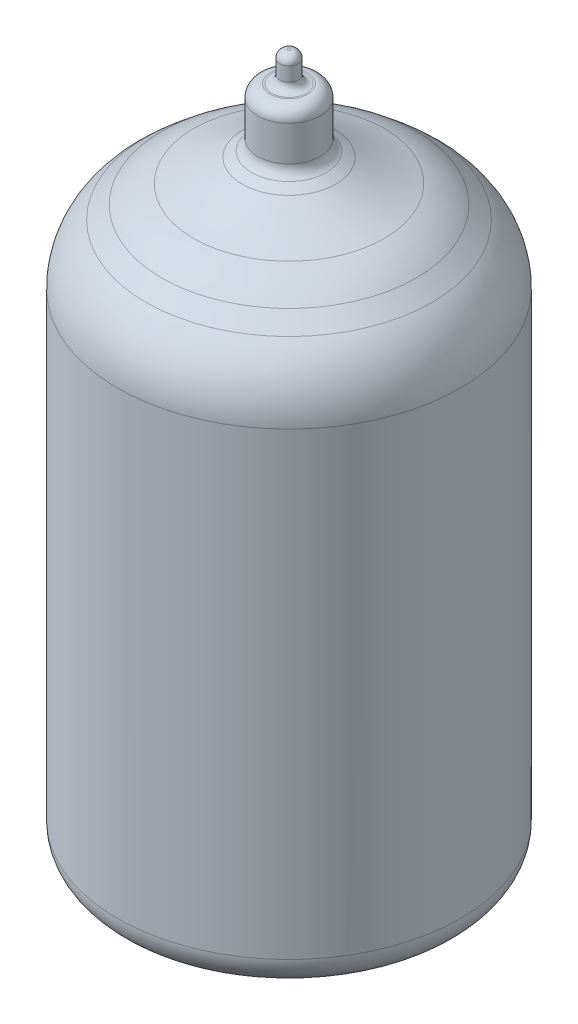
ISO-10303-21;
HEADER;
FILE_DESCRIPTION(('STEP AP214'),'2;1');
FILE_NAME('part.step','',(''),(''),'','','');
FILE_SCHEMA(('AUTOMOTIVE_DESIGN { 1 0 10303 214 1 1 1 1 }'));
ENDSEC;
DATA;
#1=APPLICATION_CONTEXT('core data for automotive mechanical design processes');
#2=APPLICATION_PROTOCOL_DEFINITION('international standard','automotive_design',2000,#1);
#3=PRODUCT_CONTEXT('',#1,'mechanical');
#4=PRODUCT('Part','Part','',(#3));
#5=PRODUCT_RELATED_PRODUCT_CATEGORY('part','',(#4));
#6=PRODUCT_DEFINITION_FORMATION('','',#4);
#7=PRODUCT_DEFINITION_CONTEXT('part definition',#1,'design');
#8=PRODUCT_DEFINITION('design','',#6,#7);
#9=PRODUCT_DEFINITION_SHAPE('','',#8);
#10=(LENGTH_UNIT() NAMED_UNIT(*) SI_UNIT(.MILLI.,.METRE.));
#11=(NAMED_UNIT(*) PLANE_ANGLE_UNIT() SI_UNIT($,.RADIAN.));
#12=(NAMED_UNIT(*) SI_UNIT($,.STERADIAN.) SOLID_ANGLE_UNIT());
#13=UNCERTAINTY_MEASURE_WITH_UNIT(LENGTH_MEASURE(1.E-05),#10,'distance_accuracy_value','');
#14=(GEOMETRIC_REPRESENTATION_CONTEXT(3) GLOBAL_UNCERTAINTY_ASSIGNED_CONTEXT((#13)) GLOBAL_UNIT_ASSIGNED_CONTEXT((#10,
#11,#12)) REPRESENTATION_CONTEXT('',''));
#15=CARTESIAN_POINT('',(0.,0.,0.));
#16=DIRECTION('',(0.,0.,1.));
#17=DIRECTION('',(1.,0.,0.));
#18=AXIS2_PLACEMENT_3D('',#15,#16,#17);
#19=CARTESIAN_POINT('',(0.,35.,0.));
#20=DIRECTION('',(0.,-1.,0.));
#21=DIRECTION('',(0.,0.,-1.));
#22=AXIS2_PLACEMENT_3D('',#19,#20,#21);
#23=CONICAL_SURFACE('',#22,11.0000000000001,0.880869672137726);
#24=CARTESIAN_POINT('',(0.,37.3414230678486,0.));
#25=DIRECTION('',(0.,1.,0.));
#26=DIRECTION('',(0.,0.,1.));
#27=AXIS2_PLACEMENT_3D('',#24,#25,#26);
#28=CIRCLE('',#27,8.16264331971948);
#29=CARTESIAN_POINT('',(0.,37.3414230678486,8.16264331971948));
#30=VERTEX_POINT('',#29);
#31=EDGE_CURVE('E69',#30,#30,#28,.F.);
#32=ORIENTED_EDGE('',*,*,#31,.T.);
#33=EDGE_LOOP('',(#32));
#34=FACE_BOUND('',#33,.T.);
#35=CARTESIAN_POINT('',(0.,36.4999042661148,0.));
#36=DIRECTION('',(0.,1.,0.));
#37=DIRECTION('',(0.,0.,1.));
#38=AXIS2_PLACEMENT_3D('',#35,#36,#37);
#39=CIRCLE('',#38,9.18240306603264);
#40=CARTESIAN_POINT('',(0.,36.4999042661148,9.18240306603264));
#41=VERTEX_POINT('',#40);
#42=EDGE_CURVE('E78',#41,#41,#39,.T.);
#43=ORIENTED_EDGE('',*,*,#42,.T.);
#44=EDGE_LOOP('',(#43));
#45=FACE_BOUND('',#44,.T.);
#46=ADVANCED_FACE('F33',(#34,#45),#23,.T.);
#47=CARTESIAN_POINT('',(0.,57.2928245965313,0.));
#48=DIRECTION('',(0.,1.,0.));
#49=DIRECTION('',(0.,0.,1.));
#50=AXIS2_PLACEMENT_3D('',#47,#48,#49);
#51=DEGENERATE_TOROIDAL_SURFACE('',#50,12.9999999999997,20.,.T.);
#52=CARTESIAN_POINT('',(0.,38.5147131680826,0.));
#53=DIRECTION('',(0.,1.,0.));
#54=DIRECTION('',(0.,0.,1.));
#55=AXIS2_PLACEMENT_3D('',#52,#53,#54);
#56=CIRCLE('',#55,6.11650298316582);
#57=CARTESIAN_POINT('',(0.,38.5147131680826,6.11650298316582));
#58=VERTEX_POINT('',#57);
#59=EDGE_CURVE('E72',#58,#58,#56,.T.);
#60=ORIENTED_EDGE('',*,*,#59,.T.);
#61=EDGE_LOOP('',(#60));
#62=FACE_BOUND('',#61,.T.);
#63=CARTESIAN_POINT('',(0.,39.9723165208424,0.));
#64=DIRECTION('',(0.,1.,0.));
#65=DIRECTION('',(0.,0.,1.));
#66=AXIS2_PLACEMENT_3D('',#63,#64,#65);
#67=CIRCLE('',#66,2.99999999999998);
#68=CARTESIAN_POINT('',(0.,39.9723165208424,2.99999999999998));
#69=VERTEX_POINT('',#68);
#70=EDGE_CURVE('E81',#69,#69,#67,.T.);
#71=ORIENTED_EDGE('',*,*,#70,.F.);
#72=EDGE_LOOP('',(#71));
#73=FACE_BOUND('',#72,.T.);
#74=ADVANCED_FACE('F292',(#62,#73),#51,.F.);
#75=CARTESIAN_POINT('',(0.,41.8106123577551,0.));
#76=DIRECTION('',(0.,1.,0.));
#77=DIRECTION('',(0.,0.,1.));
#78=AXIS2_PLACEMENT_3D('',#75,#76,#77);
#79=CYLINDRICAL_SURFACE('',#78,11.0000000000001);
#80=CARTESIAN_POINT('',(0.,32.6434407663126,0.));
#81=DIRECTION('',(0.,-1.,0.));
#82=DIRECTION('',(0.,0.,-1.));
#83=AXIS2_PLACEMENT_3D('',#80,#81,#82);
#84=CIRCLE('',#83,11.0000000000001);
#85=CARTESIAN_POINT('',(0.,32.6434407663126,-11.0000000000001));
#86=VERTEX_POINT('',#85);
#87=EDGE_CURVE('E75',#86,#86,#84,.T.);
#88=ORIENTED_EDGE('',*,*,#87,.T.);
#89=EDGE_LOOP('',(#88));
#90=FACE_BOUND('',#89,.T.);
#91=CARTESIAN_POINT('',(0.,3.17,0.));
#92=DIRECTION('',(0.,1.,0.));
#93=DIRECTION('',(-1.,0.,0.));
#94=AXIS2_PLACEMENT_3D('',#91,#92,#93);
#95=CIRCLE('',#94,11.0000000000001);
#96=CARTESIAN_POINT('',(-11.0000000000001,3.17,0.));
#97=VERTEX_POINT('',#96);
#98=EDGE_CURVE('E129',#97,#97,#95,.T.);
#99=ORIENTED_EDGE('',*,*,#98,.T.);
#100=EDGE_LOOP('',(#99));
#101=FACE_BOUND('',#100,.T.);
#102=ADVANCED_FACE('F288',(#90,#101),#79,.T.);
#103=CARTESIAN_POINT('',(0.,32.6434407663126,0.));
#104=DIRECTION('',(0.,-1.,0.));
#105=DIRECTION('',(0.,0.,-1.));
#106=AXIS2_PLACEMENT_3D('',#103,#104,#105);
#107=TOROIDAL_SURFACE('',#106,6.00000000000012,5.);
#108=ORIENTED_EDGE('',*,*,#87,.F.);
#109=EDGE_LOOP('',(#108));
#110=FACE_BOUND('',#109,.T.);
#111=ORIENTED_EDGE('',*,*,#42,.F.);
#112=EDGE_LOOP('',(#111));
#113=FACE_BOUND('',#112,.T.);
#114=ADVANCED_FACE('F291',(#110,#113),#107,.T.);
#115=CARTESIAN_POINT('',(0.,31.9423741681255,0.));
#116=DIRECTION('',(0.,-1.,0.));
#117=DIRECTION('',(0.,0.,-1.));
#118=AXIS2_PLACEMENT_3D('',#115,#116,#117);
#119=DEGENERATE_TOROIDAL_SURFACE('',#118,3.70727902727395,7.,.T.);
#120=ORIENTED_EDGE('',*,*,#31,.F.);
#121=EDGE_LOOP('',(#120));
#122=FACE_BOUND('',#121,.T.);
#123=ORIENTED_EDGE('',*,*,#59,.F.);
#124=EDGE_LOOP('',(#123));
#125=FACE_BOUND('',#124,.T.);
#126=ADVANCED_FACE('F35',(#122,#125),#119,.T.);
#127=CARTESIAN_POINT('',(0.,39.9723165208424,0.));
#128=DIRECTION('',(0.,-1.,0.));
#129=DIRECTION('',(0.,0.,-1.));
#130=AXIS2_PLACEMENT_3D('',#127,#128,#129);
#131=CONICAL_SURFACE('',#130,2.99999999999999,1.0471975511966);
#132=CARTESIAN_POINT('',(0.,40.3187266823562,0.));
#133=DIRECTION('',(0.,1.,0.));
#134=DIRECTION('',(0.,0.,1.));
#135=AXIS2_PLACEMENT_3D('',#132,#133,#134);
#136=CIRCLE('',#135,2.4);
#137=CARTESIAN_POINT('',(0.,40.3187266823562,2.4));
#138=VERTEX_POINT('',#137);
#139=EDGE_CURVE('E89',#138,#138,#136,.T.);
#140=ORIENTED_EDGE('',*,*,#139,.F.);
#141=EDGE_LOOP('',(#140));
#142=FACE_BOUND('',#141,.T.);
#143=ORIENTED_EDGE('',*,*,#70,.T.);
#144=EDGE_LOOP('',(#143));
#145=FACE_BOUND('',#144,.T.);
#146=ADVANCED_FACE('F259',(#142,#145),#131,.T.);
#147=CARTESIAN_POINT('',(0.,41.0115470053837,0.));
#148=DIRECTION('',(0.,1.,0.));
#149=DIRECTION('',(0.,0.,1.));
#150=AXIS2_PLACEMENT_3D('',#147,#148,#149);
#151=TOROIDAL_SURFACE('',#150,2.8,0.800000000000001);
#152=CARTESIAN_POINT('',(0.,41.0115470053837,0.));
#153=DIRECTION('',(0.,1.,0.));
#154=DIRECTION('',(0.,0.,1.));
#155=AXIS2_PLACEMENT_3D('',#152,#153,#154);
#156=CIRCLE('',#155,2.);
#157=CARTESIAN_POINT('',(0.,41.0115470053837,2.));
#158=VERTEX_POINT('',#157);
#159=EDGE_CURVE('E102',#158,#158,#156,.T.);
#160=ORIENTED_EDGE('',*,*,#159,.F.);
#161=EDGE_LOOP('',(#160));
#162=FACE_BOUND('',#161,.T.);
#163=ORIENTED_EDGE('',*,*,#139,.T.);
#164=EDGE_LOOP('',(#163));
#165=FACE_BOUND('',#164,.T.);
#166=ADVANCED_FACE('F255',(#162,#165),#151,.F.);
#167=CARTESIAN_POINT('',(0.,46.2723165208424,0.));
#168=DIRECTION('',(0.,1.,0.));
#169=DIRECTION('',(0.,0.,1.));
#170=AXIS2_PLACEMENT_3D('',#167,#168,#169);
#171=CYLINDRICAL_SURFACE('',#170,2.);
#172=CARTESIAN_POINT('',(0.,43.2723165208424,0.));
#173=DIRECTION('',(0.,1.,0.));
#174=DIRECTION('',(0.,0.,1.));
#175=AXIS2_PLACEMENT_3D('',#172,#173,#174);
#176=CIRCLE('',#175,2.);
#177=CARTESIAN_POINT('',(0.,43.2723165208424,2.));
#178=VERTEX_POINT('',#177);
#179=EDGE_CURVE('E105',#178,#178,#176,.T.);
#180=ORIENTED_EDGE('',*,*,#179,.F.);
#181=EDGE_LOOP('',(#180));
#182=FACE_BOUND('',#181,.T.);
#183=ORIENTED_EDGE('',*,*,#159,.T.);
#184=EDGE_LOOP('',(#183));
#185=FACE_BOUND('',#184,.T.);
#186=ADVANCED_FACE('F251',(#182,#185),#171,.T.);
#187=CARTESIAN_POINT('',(0.,43.2723165208424,0.));
#188=DIRECTION('',(0.,1.,0.));
#189=DIRECTION('',(0.,0.,1.));
#190=AXIS2_PLACEMENT_3D('',#187,#188,#189);
#191=TOROIDAL_SURFACE('',#190,1.2,0.800000000000001);
#192=CARTESIAN_POINT('',(0.,44.0723165208424,0.));
#193=DIRECTION('',(0.,1.,0.));
#194=DIRECTION('',(0.,0.,1.));
#195=AXIS2_PLACEMENT_3D('',#192,#193,#194);
#196=CIRCLE('',#195,1.2);
#197=CARTESIAN_POINT('',(0.,44.0723165208424,1.2));
#198=VERTEX_POINT('',#197);
#199=EDGE_CURVE('E108',#198,#198,#196,.T.);
#200=ORIENTED_EDGE('',*,*,#199,.F.);
#201=EDGE_LOOP('',(#200));
#202=FACE_BOUND('',#201,.T.);
#203=ORIENTED_EDGE('',*,*,#179,.T.);
#204=EDGE_LOOP('',(#203));
#205=FACE_BOUND('',#204,.T.);
#206=ADVANCED_FACE('F247',(#202,#205),#191,.T.);
#207=CARTESIAN_POINT('',(0.,44.0723165208424,-1.2));
#208=DIRECTION('',(0.,-1.,0.));
#209=DIRECTION('',(0.,0.,-1.));
#210=AXIS2_PLACEMENT_3D('',#207,#208,#209);
#211=PLANE('',#210);
#212=CARTESIAN_POINT('',(0.,44.0723165208424,0.));
#213=DIRECTION('',(0.,1.,0.));
#214=DIRECTION('',(0.,0.,1.));
#215=AXIS2_PLACEMENT_3D('',#212,#213,#214);
#216=CIRCLE('',#215,1.1);
#217=CARTESIAN_POINT('',(0.,44.0723165208424,1.1));
#218=VERTEX_POINT('',#217);
#219=EDGE_CURVE('E111',#218,#218,#216,.T.);
#220=ORIENTED_EDGE('',*,*,#219,.F.);
#221=EDGE_LOOP('',(#220));
#222=FACE_BOUND('',#221,.T.);
#223=ORIENTED_EDGE('',*,*,#199,.T.);
#224=EDGE_LOOP('',(#223));
#225=FACE_BOUND('',#224,.T.);
#226=ADVANCED_FACE('F243',(#222,#225),#211,.F.);
#227=CARTESIAN_POINT('',(0.,44.5723165208424,0.));
#228=DIRECTION('',(0.,1.,0.));
#229=DIRECTION('',(0.,0.,1.));
#230=AXIS2_PLACEMENT_3D('',#227,#228,#229);
#231=TOROIDAL_SURFACE('',#230,1.1,0.5);
#232=CARTESIAN_POINT('',(0.,44.5723165208424,0.));
#233=DIRECTION('',(0.,1.,0.));
#234=DIRECTION('',(0.,0.,1.));
#235=AXIS2_PLACEMENT_3D('',#232,#233,#234);
#236=CIRCLE('',#235,0.6);
#237=CARTESIAN_POINT('',(0.,44.5723165208424,0.6));
#238=VERTEX_POINT('',#237);
#239=EDGE_CURVE('E114',#238,#238,#236,.T.);
#240=ORIENTED_EDGE('',*,*,#239,.F.);
#241=EDGE_LOOP('',(#240));
#242=FACE_BOUND('',#241,.T.);
#243=ORIENTED_EDGE('',*,*,#219,.T.);
#244=EDGE_LOOP('',(#243));
#245=FACE_BOUND('',#244,.T.);
#246=ADVANCED_FACE('F239',(#242,#245),#231,.F.);
#247=CARTESIAN_POINT('',(0.,46.2723165208424,0.));
#248=DIRECTION('',(0.,1.,0.));
#249=DIRECTION('',(0.,0.,1.));
#250=AXIS2_PLACEMENT_3D('',#247,#248,#249);
#251=CYLINDRICAL_SURFACE('',#250,0.6);
#252=CARTESIAN_POINT('',(0.,45.4723165208424,0.));
#253=DIRECTION('',(0.,1.,0.));
#254=DIRECTION('',(0.,0.,1.));
#255=AXIS2_PLACEMENT_3D('',#252,#253,#254);
#256=CIRCLE('',#255,0.6);
#257=CARTESIAN_POINT('',(0.,45.4723165208424,0.6));
#258=VERTEX_POINT('',#257);
#259=EDGE_CURVE('E117',#258,#258,#256,.T.);
#260=ORIENTED_EDGE('',*,*,#259,.F.);
#261=EDGE_LOOP('',(#260));
#262=FACE_BOUND('',#261,.T.);
#263=ORIENTED_EDGE('',*,*,#239,.T.);
#264=EDGE_LOOP('',(#263));
#265=FACE_BOUND('',#264,.T.);
#266=ADVANCED_FACE('F235',(#262,#265),#251,.T.);
#267=CARTESIAN_POINT('',(0.,45.4723165208424,0.));
#268=DIRECTION('',(0.,1.,0.));
#269=DIRECTION('',(0.,0.,1.));
#270=AXIS2_PLACEMENT_3D('',#267,#268,#269);
#271=DEGENERATE_TOROIDAL_SURFACE('',#270,0.1,0.5,.T.);
#272=CARTESIAN_POINT('',(0.,45.9723165208424,0.));
#273=DIRECTION('',(0.,1.,0.));
#274=DIRECTION('',(0.,0.,1.));
#275=AXIS2_PLACEMENT_3D('',#272,#273,#274);
#276=CIRCLE('',#275,0.0999999999999998);
#277=CARTESIAN_POINT('',(0.,45.9723165208424,0.0999999999999998));
#278=VERTEX_POINT('',#277);
#279=EDGE_CURVE('E120',#278,#278,#276,.T.);
#280=ORIENTED_EDGE('',*,*,#279,.F.);
#281=EDGE_LOOP('',(#280));
#282=FACE_BOUND('',#281,.T.);
#283=ORIENTED_EDGE('',*,*,#259,.T.);
#284=EDGE_LOOP('',(#283));
#285=FACE_BOUND('',#284,.T.);
#286=ADVANCED_FACE('F231',(#282,#285),#271,.T.);
#287=CARTESIAN_POINT('',(0.,45.9723165208424,-0.0999999999999999));
#288=DIRECTION('',(0.,-1.,0.));
#289=DIRECTION('',(0.,0.,-1.));
#290=AXIS2_PLACEMENT_3D('',#287,#288,#289);
#291=PLANE('',#290);
#292=ORIENTED_EDGE('',*,*,#279,.T.);
#293=EDGE_LOOP('',(#292));
#294=FACE_BOUND('',#293,.T.);
#295=ADVANCED_FACE('F227',(#294),#291,.F.);
#296=CARTESIAN_POINT('',(0.,0.,0.));
#297=DIRECTION('',(0.,-1.,0.));
#298=DIRECTION('',(1.,0.,0.));
#299=AXIS2_PLACEMENT_3D('',#296,#297,#298);
#300=PLANE('',#299);
#301=CARTESIAN_POINT('',(0.,0.,0.));
#302=DIRECTION('',(0.,1.,0.));
#303=DIRECTION('',(-1.,0.,0.));
#304=AXIS2_PLACEMENT_3D('',#301,#302,#303);
#305=CIRCLE('',#304,5.78545141923821);
#306=CARTESIAN_POINT('',(-5.78545141923821,0.,0.));
#307=VERTEX_POINT('',#306);
#308=EDGE_CURVE('E138',#307,#307,#305,.T.);
#309=ORIENTED_EDGE('',*,*,#308,.F.);
#310=EDGE_LOOP('',(#309));
#311=FACE_BOUND('',#310,.T.);
#312=ADVANCED_FACE('F230',(#311),#300,.T.);
#313=CARTESIAN_POINT('',(0.,2.,0.));
#314=DIRECTION('',(0.,1.,0.));
#315=DIRECTION('',(-1.,0.,0.));
#316=AXIS2_PLACEMENT_3D('',#313,#314,#315);
#317=TOROIDAL_SURFACE('',#316,5.78545141923821,2.);
#318=ORIENTED_EDGE('',*,*,#308,.T.);
#319=EDGE_LOOP('',(#318));
#320=FACE_BOUND('',#319,.T.);
#321=CARTESIAN_POINT('',(0.,0.120614758428182,0.));
#322=DIRECTION('',(0.,1.,0.));
#323=DIRECTION('',(-1.,0.,0.));
#324=AXIS2_PLACEMENT_3D('',#321,#322,#323);
#325=CIRCLE('',#324,6.46949170588955);
#326=CARTESIAN_POINT('',(-6.46949170588955,0.120614758428183,0.));
#327=VERTEX_POINT('',#326);
#328=EDGE_CURVE('E135',#327,#327,#325,.T.);
#329=ORIENTED_EDGE('',*,*,#328,.F.);
#330=EDGE_LOOP('',(#329));
#331=FACE_BOUND('',#330,.T.);
#332=ADVANCED_FACE('F318',(#320,#331),#317,.T.);
#333=CARTESIAN_POINT('',(0.,1.29061475842818,0.));
#334=DIRECTION('',(0.,1.,0.));
#335=DIRECTION('',(-1.,0.,0.));
#336=AXIS2_PLACEMENT_3D('',#333,#334,#335);
#337=CONICAL_SURFACE('',#336,9.68404028665146,1.22173047639603);
#338=ORIENTED_EDGE('',*,*,#328,.T.);
#339=EDGE_LOOP('',(#338));
#340=FACE_BOUND('',#339,.T.);
#341=CARTESIAN_POINT('',(0.,1.29061475842818,0.));
#342=DIRECTION('',(0.,1.,0.));
#343=DIRECTION('',(-1.,0.,0.));
#344=AXIS2_PLACEMENT_3D('',#341,#342,#343);
#345=CIRCLE('',#344,9.68404028665146);
#346=CARTESIAN_POINT('',(-9.68404028665146,1.29061475842818,0.));
#347=VERTEX_POINT('',#346);
#348=EDGE_CURVE('E132',#347,#347,#345,.T.);
#349=ORIENTED_EDGE('',*,*,#348,.F.);
#350=EDGE_LOOP('',(#349));
#351=FACE_BOUND('',#350,.T.);
#352=ADVANCED_FACE('F313',(#340,#351),#337,.T.);
#353=CARTESIAN_POINT('',(0.,3.17,0.));
#354=DIRECTION('',(0.,1.,0.));
#355=DIRECTION('',(-1.,0.,0.));
#356=AXIS2_PLACEMENT_3D('',#353,#354,#355);
#357=TOROIDAL_SURFACE('',#356,9.00000000000013,2.);
#358=ORIENTED_EDGE('',*,*,#348,.T.);
#359=EDGE_LOOP('',(#358));
#360=FACE_BOUND('',#359,.T.);
#361=ORIENTED_EDGE('',*,*,#98,.F.);
#362=EDGE_LOOP('',(#361));
#363=FACE_BOUND('',#362,.T.);
#364=ADVANCED_FACE('F312',(#360,#363),#357,.T.);
#365=CLOSED_SHELL('',(#46,#74,#102,#114,#126,#146,#166,#186,#206,#226,#246,#266,#286,#295,#312,
#332,#352,#364));
#366=CARTESIAN_POINT('',(-10.0000000000001,2.72,0.));
#367=DIRECTION('',(0.,1.,0.));
#368=DIRECTION('',(-1.,0.,0.));
#369=AXIS2_PLACEMENT_3D('',#366,#367,#368);
#370=PLANE('',#369);
#371=CARTESIAN_POINT('',(4.81365111653086,2.72,-3.49732225114016));
#372=DIRECTION('',(0.,1.,0.));
#373=DIRECTION('',(-1.,0.,0.));
#374=AXIS2_PLACEMENT_3D('',#371,#372,#373);
#375=CIRCLE('',#374,1.50707658144959);
#376=CARTESIAN_POINT('',(3.30657453508127,2.72,-3.49732225114016));
#377=VERTEX_POINT('',#376);
#378=EDGE_CURVE('E10',#377,#377,#375,.T.);
#379=ORIENTED_EDGE('',*,*,#378,.F.);
#380=EDGE_LOOP('',(#379));
#381=FACE_BOUND('',#380,.T.);
#382=CARTESIAN_POINT('',(1.83865111653091,2.72,-5.65878627195608));
#383=DIRECTION('',(0.,1.,0.));
#384=DIRECTION('',(-1.,0.,0.));
#385=AXIS2_PLACEMENT_3D('',#382,#383,#384);
#386=CIRCLE('',#385,1.50707658144959);
#387=CARTESIAN_POINT('',(0.33157453508132,2.72,-5.65878627195608));
#388=VERTEX_POINT('',#387);
#389=EDGE_CURVE('E41',#388,#388,#386,.T.);
#390=ORIENTED_EDGE('',*,*,#389,.F.);
#391=EDGE_LOOP('',(#390));
#392=FACE_BOUND('',#391,.T.);
#393=CARTESIAN_POINT('',(-1.83865111653091,2.72,-5.65878627195608));
#394=DIRECTION('',(0.,1.,0.));
#395=DIRECTION('',(-1.,0.,0.));
#396=AXIS2_PLACEMENT_3D('',#393,#394,#395);
#397=CIRCLE('',#396,1.50707658144959);
#398=CARTESIAN_POINT('',(-3.3457276979805,2.72,-5.65878627195608));
#399=VERTEX_POINT('',#398);
#400=EDGE_CURVE('E45',#399,#399,#397,.T.);
#401=ORIENTED_EDGE('',*,*,#400,.F.);
#402=EDGE_LOOP('',(#401));
#403=FACE_BOUND('',#402,.T.);
#404=CARTESIAN_POINT('',(-4.81365111653086,2.72,-3.49732225114016));
#405=DIRECTION('',(0.,1.,0.));
#406=DIRECTION('',(-1.,0.,0.));
#407=AXIS2_PLACEMENT_3D('',#404,#405,#406);
#408=CIRCLE('',#407,1.50707658144959);
#409=CARTESIAN_POINT('',(-6.32072769798045,2.72,-3.49732225114016));
#410=VERTEX_POINT('',#409);
#411=EDGE_CURVE('E49',#410,#410,#408,.T.);
#412=ORIENTED_EDGE('',*,*,#411,.F.);
#413=EDGE_LOOP('',(#412));
#414=FACE_BOUND('',#413,.T.);
#415=CARTESIAN_POINT('',(-5.94999999999991,2.72,0.));
#416=DIRECTION('',(0.,1.,0.));
#417=DIRECTION('',(-1.,0.,0.));
#418=AXIS2_PLACEMENT_3D('',#415,#416,#417);
#419=CIRCLE('',#418,1.50707658144959);
#420=CARTESIAN_POINT('',(-7.4570765814495,2.72,0.));
#421=VERTEX_POINT('',#420);
#422=EDGE_CURVE('E54',#421,#421,#419,.T.);
#423=ORIENTED_EDGE('',*,*,#422,.F.);
#424=EDGE_LOOP('',(#423));
#425=FACE_BOUND('',#424,.T.);
#426=CARTESIAN_POINT('',(-4.81365111653086,2.72,3.49732225114016));
#427=DIRECTION('',(0.,1.,0.));
#428=DIRECTION('',(-1.,0.,0.));
#429=AXIS2_PLACEMENT_3D('',#426,#427,#428);
#430=CIRCLE('',#429,1.50707658144959);
#431=CARTESIAN_POINT('',(-6.32072769798045,2.72,3.49732225114016));
#432=VERTEX_POINT('',#431);
#433=EDGE_CURVE('E57',#432,#432,#430,.T.);
#434=ORIENTED_EDGE('',*,*,#433,.F.);
#435=EDGE_LOOP('',(#434));
#436=FACE_BOUND('',#435,.T.);
#437=CARTESIAN_POINT('',(-1.83865111653091,2.72,5.65878627195608));
#438=DIRECTION('',(0.,1.,0.));
#439=DIRECTION('',(-1.,0.,0.));
#440=AXIS2_PLACEMENT_3D('',#437,#438,#439);
#441=CIRCLE('',#440,1.50707658144959);
#442=CARTESIAN_POINT('',(-3.3457276979805,2.72,5.65878627195608));
#443=VERTEX_POINT('',#442);
#444=EDGE_CURVE('E60',#443,#443,#441,.T.);
#445=ORIENTED_EDGE('',*,*,#444,.F.);
#446=EDGE_LOOP('',(#445));
#447=FACE_BOUND('',#446,.T.);
#448=CARTESIAN_POINT('',(1.83865111653091,2.72,5.65878627195608));
#449=DIRECTION('',(0.,1.,0.));
#450=DIRECTION('',(-1.,0.,0.));
#451=AXIS2_PLACEMENT_3D('',#448,#449,#450);
#452=CIRCLE('',#451,1.50707658144959);
#453=CARTESIAN_POINT('',(0.331574535081318,2.72,5.65878627195608));
#454=VERTEX_POINT('',#453);
#455=EDGE_CURVE('E63',#454,#454,#452,.T.);
#456=ORIENTED_EDGE('',*,*,#455,.F.);
#457=EDGE_LOOP('',(#456));
#458=FACE_BOUND('',#457,.T.);
#459=CARTESIAN_POINT('',(4.81365111653087,2.72,3.49732225114016));
#460=DIRECTION('',(0.,1.,0.));
#461=DIRECTION('',(-1.,0.,0.));
#462=AXIS2_PLACEMENT_3D('',#459,#460,#461);
#463=CIRCLE('',#462,1.50707658144959);
#464=CARTESIAN_POINT('',(3.30657453508127,2.72,3.49732225114016));
#465=VERTEX_POINT('',#464);
#466=EDGE_CURVE('E66',#465,#465,#463,.T.);
#467=ORIENTED_EDGE('',*,*,#466,.F.);
#468=EDGE_LOOP('',(#467));
#469=FACE_BOUND('',#468,.T.);
#470=CARTESIAN_POINT('',(0.,2.72,0.));
#471=DIRECTION('',(0.,1.,0.));
#472=DIRECTION('',(-1.,0.,0.));
#473=AXIS2_PLACEMENT_3D('',#470,#471,#472);
#474=CIRCLE('',#473,10.0000000000001);
#475=CARTESIAN_POINT('',(-10.0000000000001,2.72,0.));
#476=VERTEX_POINT('',#475);
#477=EDGE_CURVE('E123',#476,#476,#474,.T.);
#478=ORIENTED_EDGE('',*,*,#477,.T.);
#479=EDGE_LOOP('',(#478));
#480=FACE_BOUND('',#479,.T.);
#481=ADVANCED_FACE('F212',(#381,#392,#403,#414,#425,#436,#447,#458,#469,#480),#370,.T.);
#482=CARTESIAN_POINT('',(0.,3.12,0.));
#483=DIRECTION('',(0.,1.,0.));
#484=DIRECTION('',(-1.,0.,0.));
#485=AXIS2_PLACEMENT_3D('',#482,#483,#484);
#486=TOROIDAL_SURFACE('',#485,10.0000000000001,0.4);
#487=CARTESIAN_POINT('',(0.,3.12,0.));
#488=DIRECTION('',(0.,1.,0.));
#489=DIRECTION('',(-1.,0.,0.));
#490=AXIS2_PLACEMENT_3D('',#487,#488,#489);
#491=CIRCLE('',#490,10.4000000000001);
#492=CARTESIAN_POINT('',(-10.4000000000001,3.12,0.));
#493=VERTEX_POINT('',#492);
#494=EDGE_CURVE('E126',#493,#493,#491,.T.);
#495=ORIENTED_EDGE('',*,*,#494,.T.);
#496=EDGE_LOOP('',(#495));
#497=FACE_BOUND('',#496,.T.);
#498=ORIENTED_EDGE('',*,*,#477,.F.);
#499=EDGE_LOOP('',(#498));
#500=FACE_BOUND('',#499,.T.);
#501=ADVANCED_FACE('F214',(#497,#500),#486,.F.);
#502=CARTESIAN_POINT('',(0.,39.3723165208424,-2.99999999999998));
#503=DIRECTION('',(0.,-1.,0.));
#504=DIRECTION('',(0.,0.,-1.));
#505=AXIS2_PLACEMENT_3D('',#502,#503,#504);
#506=PLANE('',#505);
#507=CARTESIAN_POINT('',(0.,39.3723165208424,0.));
#508=DIRECTION('',(0.,1.,0.));
#509=DIRECTION('',(0.,0.,1.));
#510=AXIS2_PLACEMENT_3D('',#507,#508,#509);
#511=CIRCLE('',#510,2.84050245783908);
#512=CARTESIAN_POINT('',(0.,39.3723165208424,2.84050245783908));
#513=VERTEX_POINT('',#512);
#514=EDGE_CURVE('E85',#513,#513,#511,.T.);
#515=ORIENTED_EDGE('',*,*,#514,.F.);
#516=EDGE_LOOP('',(#515));
#517=FACE_BOUND('',#516,.T.);
#518=ADVANCED_FACE('F221',(#517),#506,.T.);
#519=CARTESIAN_POINT('',(0.,57.2928245965313,0.));
#520=DIRECTION('',(0.,1.,0.));
#521=DIRECTION('',(0.,0.,1.));
#522=AXIS2_PLACEMENT_3D('',#519,#520,#521);
#523=DEGENERATE_TOROIDAL_SURFACE('',#522,12.9999999999997,20.6,.T.);
#524=CARTESIAN_POINT('',(0.,37.9513698252291,0.));
#525=DIRECTION('',(0.,1.,0.));
#526=DIRECTION('',(0.,0.,1.));
#527=AXIS2_PLACEMENT_3D('',#524,#525,#526);
#528=CIRCLE('',#527,5.9099980726608);
#529=CARTESIAN_POINT('',(0.,37.9513698252291,5.9099980726608));
#530=VERTEX_POINT('',#529);
#531=EDGE_CURVE('E90',#530,#530,#528,.T.);
#532=ORIENTED_EDGE('',*,*,#531,.F.);
#533=EDGE_LOOP('',(#532));
#534=FACE_BOUND('',#533,.T.);
#535=ORIENTED_EDGE('',*,*,#514,.T.);
#536=EDGE_LOOP('',(#535));
#537=FACE_BOUND('',#536,.T.);
#538=ADVANCED_FACE('F270',(#534,#537),#523,.T.);
#539=CARTESIAN_POINT('',(0.,31.9423741681255,0.));
#540=DIRECTION('',(0.,-1.,0.));
#541=DIRECTION('',(0.,0.,-1.));
#542=AXIS2_PLACEMENT_3D('',#539,#540,#541);
#543=DEGENERATE_TOROIDAL_SURFACE('',#542,3.70727902727395,6.4,.T.);
#544=CARTESIAN_POINT('',(0.,36.8786474478723,0.));
#545=DIRECTION('',(0.,-1.,0.));
#546=DIRECTION('',(0.,0.,-1.));
#547=AXIS2_PLACEMENT_3D('',#544,#545,#546);
#548=CIRCLE('',#547,7.78075495179558);
#549=CARTESIAN_POINT('',(0.,36.8786474478723,-7.78075495179558));
#550=VERTEX_POINT('',#549);
#551=EDGE_CURVE('E84',#550,#550,#548,.T.);
#552=ORIENTED_EDGE('',*,*,#551,.T.);
#553=EDGE_LOOP('',(#552));
#554=FACE_BOUND('',#553,.T.);
#555=ORIENTED_EDGE('',*,*,#531,.T.);
#556=EDGE_LOOP('',(#555));
#557=FACE_BOUND('',#556,.T.);
#558=ADVANCED_FACE('F268',(#554,#557),#543,.F.);
#559=CARTESIAN_POINT('',(0.,34.5372243800237,0.));
#560=DIRECTION('',(0.,-1.,0.));
#561=DIRECTION('',(0.,0.,-1.));
#562=AXIS2_PLACEMENT_3D('',#559,#560,#561);
#563=CONICAL_SURFACE('',#562,10.6181116320762,0.880869672137726);
#564=ORIENTED_EDGE('',*,*,#551,.F.);
#565=EDGE_LOOP('',(#564));
#566=FACE_BOUND('',#565,.T.);
#567=CARTESIAN_POINT('',(0.,36.0371286461386,0.));
#568=DIRECTION('',(0.,-1.,0.));
#569=DIRECTION('',(0.,0.,-1.));
#570=AXIS2_PLACEMENT_3D('',#567,#568,#569);
#571=CIRCLE('',#570,8.80051469810874);
#572=CARTESIAN_POINT('',(0.,36.0371286461386,-8.80051469810874));
#573=VERTEX_POINT('',#572);
#574=EDGE_CURVE('E88',#573,#573,#571,.F.);
#575=ORIENTED_EDGE('',*,*,#574,.F.);
#576=EDGE_LOOP('',(#575));
#577=FACE_BOUND('',#576,.T.);
#578=ADVANCED_FACE('F264',(#566,#577),#563,.F.);
#579=CARTESIAN_POINT('',(0.,32.6434407663126,0.));
#580=DIRECTION('',(0.,-1.,0.));
#581=DIRECTION('',(0.,0.,-1.));
#582=AXIS2_PLACEMENT_3D('',#579,#580,#581);
#583=TOROIDAL_SURFACE('',#582,6.00000000000012,4.4);
#584=CARTESIAN_POINT('',(0.,32.6434407663126,0.));
#585=DIRECTION('',(0.,1.,0.));
#586=DIRECTION('',(0.,0.,1.));
#587=AXIS2_PLACEMENT_3D('',#584,#585,#586);
#588=CIRCLE('',#587,10.4000000000001);
#589=CARTESIAN_POINT('',(0.,32.6434407663126,10.4000000000001));
#590=VERTEX_POINT('',#589);
#591=EDGE_CURVE('E93',#590,#590,#588,.F.);
#592=ORIENTED_EDGE('',*,*,#591,.T.);
#593=EDGE_LOOP('',(#592));
#594=FACE_BOUND('',#593,.T.);
#595=ORIENTED_EDGE('',*,*,#574,.T.);
#596=EDGE_LOOP('',(#595));
#597=FACE_BOUND('',#596,.T.);
#598=ADVANCED_FACE('F267',(#594,#597),#583,.F.);
#599=CARTESIAN_POINT('',(0.,41.8106123577551,0.));
#600=DIRECTION('',(0.,1.,0.));
#601=DIRECTION('',(0.,0.,1.));
#602=AXIS2_PLACEMENT_3D('',#599,#600,#601);
#603=CYLINDRICAL_SURFACE('',#602,10.4000000000001);
#604=ORIENTED_EDGE('',*,*,#591,.F.);
#605=EDGE_LOOP('',(#604));
#606=FACE_BOUND('',#605,.T.);
#607=ORIENTED_EDGE('',*,*,#494,.F.);
#608=EDGE_LOOP('',(#607));
#609=FACE_BOUND('',#608,.T.);
#610=ADVANCED_FACE('F277',(#606,#609),#603,.F.);
#611=CARTESIAN_POINT('',(5.22826336929205,5.,3.79855568540327));
#612=DIRECTION('',(0.,1.,0.));
#613=DIRECTION('',(0.,0.,1.));
#614=AXIS2_PLACEMENT_3D('',#611,#612,#613);
#615=PLANE('',#614);
#616=CARTESIAN_POINT('',(4.81365111653087,5.,3.49732225114016));
#617=DIRECTION('',(0.,-1.,0.));
#618=DIRECTION('',(0.,0.,-1.));
#619=AXIS2_PLACEMENT_3D('',#616,#617,#618);
#620=CIRCLE('',#619,0.512488928717152);
#621=CARTESIAN_POINT('',(4.81365111653087,5.,2.98483332242301));
#622=VERTEX_POINT('',#621);
#623=EDGE_CURVE('E141',#622,#622,#620,.T.);
#624=ORIENTED_EDGE('',*,*,#623,.F.);
#625=EDGE_LOOP('',(#624));
#626=FACE_BOUND('',#625,.T.);
#627=ADVANCED_FACE('F280',(#626),#615,.T.);
#628=CARTESIAN_POINT('',(4.81365111653087,4.5,3.49732225114016));
#629=DIRECTION('',(0.,-1.,0.));
#630=DIRECTION('',(0.,0.,-1.));
#631=AXIS2_PLACEMENT_3D('',#628,#629,#630);
#632=TOROIDAL_SURFACE('',#631,0.512488928717152,0.499999999999999);
#633=ORIENTED_EDGE('',*,*,#623,.T.);
#634=EDGE_LOOP('',(#633));
#635=FACE_BOUND('',#634,.T.);
#636=CARTESIAN_POINT('',(4.81365111653087,4.62940952255126,3.49732225114016));
#637=DIRECTION('',(0.,-1.,0.));
#638=DIRECTION('',(0.,0.,-1.));
#639=AXIS2_PLACEMENT_3D('',#636,#637,#638);
#640=CIRCLE('',#639,0.995451841861684);
#641=CARTESIAN_POINT('',(4.81365111653087,4.62940952255126,2.50187040927848));
#642=VERTEX_POINT('',#641);
#643=EDGE_CURVE('E144',#642,#642,#640,.T.);
#644=ORIENTED_EDGE('',*,*,#643,.F.);
#645=EDGE_LOOP('',(#644));
#646=FACE_BOUND('',#645,.T.);
#647=ADVANCED_FACE('F330',(#635,#646),#632,.T.);
#648=CARTESIAN_POINT('',(4.81365111653087,2.,3.49732225114016));
#649=DIRECTION('',(0.,-1.,0.));
#650=DIRECTION('',(0.,0.,-1.));
#651=AXIS2_PLACEMENT_3D('',#648,#649,#650);
#652=CONICAL_SURFACE('',#651,1.7,0.26179938779915);
#653=ORIENTED_EDGE('',*,*,#466,.T.);
#654=EDGE_LOOP('',(#653));
#655=FACE_BOUND('',#654,.T.);
#656=ORIENTED_EDGE('',*,*,#643,.T.);
#657=EDGE_LOOP('',(#656));
#658=FACE_BOUND('',#657,.T.);
#659=ADVANCED_FACE('F334',(#655,#658),#652,.T.);
#660=CARTESIAN_POINT('',(1.99701890493352,5.,6.14619220714165));
#661=DIRECTION('',(0.,1.,0.));
#662=DIRECTION('',(-1.,0.,0.));
#663=AXIS2_PLACEMENT_3D('',#660,#661,#662);
#664=PLANE('',#663);
#665=CARTESIAN_POINT('',(1.83865111653091,5.,5.65878627195608));
#666=DIRECTION('',(0.,-1.,0.));
#667=DIRECTION('',(1.,0.,0.));
#668=AXIS2_PLACEMENT_3D('',#665,#666,#667);
#669=CIRCLE('',#668,0.512488928717154);
#670=CARTESIAN_POINT('',(2.35114004524806,5.,5.65878627195608));
#671=VERTEX_POINT('',#670);
#672=EDGE_CURVE('E147',#671,#671,#669,.T.);
#673=ORIENTED_EDGE('',*,*,#672,.F.);
#674=EDGE_LOOP('',(#673));
#675=FACE_BOUND('',#674,.T.);
#676=ADVANCED_FACE('F338',(#675),#664,.T.);
#677=CARTESIAN_POINT('',(1.83865111653091,4.5,5.65878627195608));
#678=DIRECTION('',(0.,-1.,0.));
#679=DIRECTION('',(1.,0.,0.));
#680=AXIS2_PLACEMENT_3D('',#677,#678,#679);
#681=TOROIDAL_SURFACE('',#680,0.512488928717154,0.499999999999999);
#682=ORIENTED_EDGE('',*,*,#672,.T.);
#683=EDGE_LOOP('',(#682));
#684=FACE_BOUND('',#683,.T.);
#685=CARTESIAN_POINT('',(1.83865111653091,4.62940952255126,5.65878627195608));
#686=DIRECTION('',(0.,-1.,0.));
#687=DIRECTION('',(1.,0.,0.));
#688=AXIS2_PLACEMENT_3D('',#685,#686,#687);
#689=CIRCLE('',#688,0.995451841861687);
#690=CARTESIAN_POINT('',(2.8341029583926,4.62940952255126,5.65878627195608));
#691=VERTEX_POINT('',#690);
#692=EDGE_CURVE('E150',#691,#691,#689,.T.);
#693=ORIENTED_EDGE('',*,*,#692,.F.);
#694=EDGE_LOOP('',(#693));
#695=FACE_BOUND('',#694,.T.);
#696=ADVANCED_FACE('F342',(#684,#695),#681,.T.);
#697=CARTESIAN_POINT('',(1.83865111653091,2.,5.65878627195608));
#698=DIRECTION('',(0.,-1.,0.));
#699=DIRECTION('',(1.,0.,0.));
#700=AXIS2_PLACEMENT_3D('',#697,#698,#699);
#701=CONICAL_SURFACE('',#700,1.7,0.261799387799149);
#702=ORIENTED_EDGE('',*,*,#455,.T.);
#703=EDGE_LOOP('',(#702));
#704=FACE_BOUND('',#703,.T.);
#705=ORIENTED_EDGE('',*,*,#692,.T.);
#706=EDGE_LOOP('',(#705));
#707=FACE_BOUND('',#706,.T.);
#708=ADVANCED_FACE('F346',(#704,#707),#701,.T.);
#709=CARTESIAN_POINT('',(-1.99701890493352,5.,6.14619220714165));
#710=DIRECTION('',(0.,1.,0.));
#711=DIRECTION('',(-1.,0.,0.));
#712=AXIS2_PLACEMENT_3D('',#709,#710,#711);
#713=PLANE('',#712);
#714=CARTESIAN_POINT('',(-1.83865111653091,5.,5.65878627195608));
#715=DIRECTION('',(0.,-1.,0.));
#716=DIRECTION('',(1.,0.,0.));
#717=AXIS2_PLACEMENT_3D('',#714,#715,#716);
#718=CIRCLE('',#717,0.512488928717154);
#719=CARTESIAN_POINT('',(-1.32616218781376,5.,5.65878627195608));
#720=VERTEX_POINT('',#719);
#721=EDGE_CURVE('E153',#720,#720,#718,.T.);
#722=ORIENTED_EDGE('',*,*,#721,.F.);
#723=EDGE_LOOP('',(#722));
#724=FACE_BOUND('',#723,.T.);
#725=ADVANCED_FACE('F350',(#724),#713,.T.);
#726=CARTESIAN_POINT('',(-1.83865111653091,4.5,5.65878627195608));
#727=DIRECTION('',(0.,-1.,0.));
#728=DIRECTION('',(1.,0.,0.));
#729=AXIS2_PLACEMENT_3D('',#726,#727,#728);
#730=TOROIDAL_SURFACE('',#729,0.512488928717154,0.499999999999999);
#731=ORIENTED_EDGE('',*,*,#721,.T.);
#732=EDGE_LOOP('',(#731));
#733=FACE_BOUND('',#732,.T.);
#734=CARTESIAN_POINT('',(-1.83865111653091,4.62940952255126,5.65878627195608));
#735=DIRECTION('',(0.,-1.,0.));
#736=DIRECTION('',(1.,0.,0.));
#737=AXIS2_PLACEMENT_3D('',#734,#735,#736);
#738=CIRCLE('',#737,0.995451841861687);
#739=CARTESIAN_POINT('',(-0.843199274669223,4.62940952255126,5.65878627195608));
#740=VERTEX_POINT('',#739);
#741=EDGE_CURVE('E156',#740,#740,#738,.T.);
#742=ORIENTED_EDGE('',*,*,#741,.F.);
#743=EDGE_LOOP('',(#742));
#744=FACE_BOUND('',#743,.T.);
#745=ADVANCED_FACE('F354',(#733,#744),#730,.T.);
#746=CARTESIAN_POINT('',(-1.83865111653091,2.,5.65878627195608));
#747=DIRECTION('',(0.,-1.,0.));
#748=DIRECTION('',(1.,0.,0.));
#749=AXIS2_PLACEMENT_3D('',#746,#747,#748);
#750=CONICAL_SURFACE('',#749,1.7,0.261799387799149);
#751=ORIENTED_EDGE('',*,*,#444,.T.);
#752=EDGE_LOOP('',(#751));
#753=FACE_BOUND('',#752,.T.);
#754=ORIENTED_EDGE('',*,*,#741,.T.);
#755=EDGE_LOOP('',(#754));
#756=FACE_BOUND('',#755,.T.);
#757=ADVANCED_FACE('F358',(#753,#756),#750,.T.);
#758=CARTESIAN_POINT('',(-4.81365111653086,2.,3.49732225114016));
#759=DIRECTION('',(0.,-1.,0.));
#760=DIRECTION('',(0.,0.,-1.));
#761=AXIS2_PLACEMENT_3D('',#758,#759,#760);
#762=CONICAL_SURFACE('',#761,1.7,0.26179938779915);
#763=ORIENTED_EDGE('',*,*,#433,.T.);
#764=EDGE_LOOP('',(#763));
#765=FACE_BOUND('',#764,.T.);
#766=CARTESIAN_POINT('',(-4.81365111653086,4.62940952255126,3.49732225114016));
#767=DIRECTION('',(0.,-1.,0.));
#768=DIRECTION('',(0.,0.,-1.));
#769=AXIS2_PLACEMENT_3D('',#766,#767,#768);
#770=CIRCLE('',#769,0.995451841861685);
#771=CARTESIAN_POINT('',(-4.81365111653086,4.62940952255126,2.50187040927848));
#772=VERTEX_POINT('',#771);
#773=EDGE_CURVE('E159',#772,#772,#770,.T.);
#774=ORIENTED_EDGE('',*,*,#773,.T.);
#775=EDGE_LOOP('',(#774));
#776=FACE_BOUND('',#775,.T.);
#777=ADVANCED_FACE('F362',(#765,#776),#762,.T.);
#778=CARTESIAN_POINT('',(-4.81365111653086,4.5,3.49732225114016));
#779=DIRECTION('',(0.,-1.,0.));
#780=DIRECTION('',(0.,0.,-1.));
#781=AXIS2_PLACEMENT_3D('',#778,#779,#780);
#782=TOROIDAL_SURFACE('',#781,0.512488928717152,0.499999999999999);
#783=CARTESIAN_POINT('',(-4.81365111653086,5.,3.49732225114016));
#784=DIRECTION('',(0.,-1.,0.));
#785=DIRECTION('',(0.,0.,-1.));
#786=AXIS2_PLACEMENT_3D('',#783,#784,#785);
#787=CIRCLE('',#786,0.512488928717152);
#788=CARTESIAN_POINT('',(-4.81365111653086,5.,2.98483332242301));
#789=VERTEX_POINT('',#788);
#790=EDGE_CURVE('E162',#789,#789,#787,.T.);
#791=ORIENTED_EDGE('',*,*,#790,.T.);
#792=EDGE_LOOP('',(#791));
#793=FACE_BOUND('',#792,.T.);
#794=ORIENTED_EDGE('',*,*,#773,.F.);
#795=EDGE_LOOP('',(#794));
#796=FACE_BOUND('',#795,.T.);
#797=ADVANCED_FACE('F366',(#793,#796),#782,.T.);
#798=CARTESIAN_POINT('',(-5.22826336929205,5.,3.79855568540327));
#799=DIRECTION('',(0.,1.,0.));
#800=DIRECTION('',(0.,0.,1.));
#801=AXIS2_PLACEMENT_3D('',#798,#799,#800);
#802=PLANE('',#801);
#803=ORIENTED_EDGE('',*,*,#790,.F.);
#804=EDGE_LOOP('',(#803));
#805=FACE_BOUND('',#804,.T.);
#806=ADVANCED_FACE('F370',(#805),#802,.T.);
#807=CARTESIAN_POINT('',(-5.94999999999991,2.,0.));
#808=DIRECTION('',(0.,-1.,0.));
#809=DIRECTION('',(0.,0.,-1.));
#810=AXIS2_PLACEMENT_3D('',#807,#808,#809);
#811=CONICAL_SURFACE('',#810,1.7,0.261799387799152);
#812=ORIENTED_EDGE('',*,*,#422,.T.);
#813=EDGE_LOOP('',(#812));
#814=FACE_BOUND('',#813,.T.);
#815=CARTESIAN_POINT('',(-5.94999999999991,4.62940952255126,0.));
#816=DIRECTION('',(0.,-1.,0.));
#817=DIRECTION('',(0.,0.,-1.));
#818=AXIS2_PLACEMENT_3D('',#815,#816,#817);
#819=CIRCLE('',#818,0.99545184186168);
#820=CARTESIAN_POINT('',(-5.94999999999991,4.62940952255126,-0.995451841861681));
#821=VERTEX_POINT('',#820);
#822=EDGE_CURVE('E165',#821,#821,#819,.T.);
#823=ORIENTED_EDGE('',*,*,#822,.T.);
#824=EDGE_LOOP('',(#823));
#825=FACE_BOUND('',#824,.T.);
#826=ADVANCED_FACE('F374',(#814,#825),#811,.T.);
#827=CARTESIAN_POINT('',(-5.94999999999991,4.5,0.));
#828=DIRECTION('',(0.,-1.,0.));
#829=DIRECTION('',(0.,0.,-1.));
#830=AXIS2_PLACEMENT_3D('',#827,#828,#829);
#831=TOROIDAL_SURFACE('',#830,0.512488928717148,0.499999999999999);
#832=CARTESIAN_POINT('',(-5.94999999999991,5.,0.));
#833=DIRECTION('',(0.,-1.,0.));
#834=DIRECTION('',(0.,0.,-1.));
#835=AXIS2_PLACEMENT_3D('',#832,#833,#834);
#836=CIRCLE('',#835,0.512488928717148);
#837=CARTESIAN_POINT('',(-5.94999999999991,5.,-0.512488928717149));
#838=VERTEX_POINT('',#837);
#839=EDGE_CURVE('E168',#838,#838,#836,.T.);
#840=ORIENTED_EDGE('',*,*,#839,.T.);
#841=EDGE_LOOP('',(#840));
#842=FACE_BOUND('',#841,.T.);
#843=ORIENTED_EDGE('',*,*,#822,.F.);
#844=EDGE_LOOP('',(#843));
#845=FACE_BOUND('',#844,.T.);
#846=ADVANCED_FACE('F378',(#842,#845),#831,.T.);
#847=CARTESIAN_POINT('',(-6.46248892871706,5.,0.));
#848=DIRECTION('',(0.,1.,0.));
#849=DIRECTION('',(0.,0.,1.));
#850=AXIS2_PLACEMENT_3D('',#847,#848,#849);
#851=PLANE('',#850);
#852=ORIENTED_EDGE('',*,*,#839,.F.);
#853=EDGE_LOOP('',(#852));
#854=FACE_BOUND('',#853,.T.);
#855=ADVANCED_FACE('F382',(#854),#851,.T.);
#856=CARTESIAN_POINT('',(-4.81365111653086,2.,-3.49732225114016));
#857=DIRECTION('',(0.,-1.,0.));
#858=DIRECTION('',(0.,0.,-1.));
#859=AXIS2_PLACEMENT_3D('',#856,#857,#858);
#860=CONICAL_SURFACE('',#859,1.7,0.261799387799153);
#861=ORIENTED_EDGE('',*,*,#411,.T.);
#862=EDGE_LOOP('',(#861));
#863=FACE_BOUND('',#862,.T.);
#864=CARTESIAN_POINT('',(-4.81365111653086,4.62940952255126,-3.49732225114016));
#865=DIRECTION('',(0.,-1.,0.));
#866=DIRECTION('',(0.,0.,-1.));
#867=AXIS2_PLACEMENT_3D('',#864,#865,#866);
#868=CIRCLE('',#867,0.995451841861675);
#869=CARTESIAN_POINT('',(-4.81365111653086,4.62940952255126,-4.49277409300184));
#870=VERTEX_POINT('',#869);
#871=EDGE_CURVE('E171',#870,#870,#868,.T.);
#872=ORIENTED_EDGE('',*,*,#871,.T.);
#873=EDGE_LOOP('',(#872));
#874=FACE_BOUND('',#873,.T.);
#875=ADVANCED_FACE('F386',(#863,#874),#860,.T.);
#876=CARTESIAN_POINT('',(-4.81365111653086,4.5,-3.49732225114016));
#877=DIRECTION('',(0.,-1.,0.));
#878=DIRECTION('',(0.,0.,-1.));
#879=AXIS2_PLACEMENT_3D('',#876,#877,#878);
#880=TOROIDAL_SURFACE('',#879,0.512488928717143,0.499999999999999);
#881=CARTESIAN_POINT('',(-4.81365111653086,5.,-3.49732225114016));
#882=DIRECTION('',(0.,-1.,0.));
#883=DIRECTION('',(0.,0.,-1.));
#884=AXIS2_PLACEMENT_3D('',#881,#882,#883);
#885=CIRCLE('',#884,0.512488928717143);
#886=CARTESIAN_POINT('',(-4.81365111653086,5.,-4.00981117985731));
#887=VERTEX_POINT('',#886);
#888=EDGE_CURVE('E174',#887,#887,#885,.T.);
#889=ORIENTED_EDGE('',*,*,#888,.T.);
#890=EDGE_LOOP('',(#889));
#891=FACE_BOUND('',#890,.T.);
#892=ORIENTED_EDGE('',*,*,#871,.F.);
#893=EDGE_LOOP('',(#892));
#894=FACE_BOUND('',#893,.T.);
#895=ADVANCED_FACE('F390',(#891,#894),#880,.T.);
#896=CARTESIAN_POINT('',(-5.22826336929204,5.,-3.79855568540327));
#897=DIRECTION('',(0.,1.,0.));
#898=DIRECTION('',(0.,0.,1.));
#899=AXIS2_PLACEMENT_3D('',#896,#897,#898);
#900=PLANE('',#899);
#901=ORIENTED_EDGE('',*,*,#888,.F.);
#902=EDGE_LOOP('',(#901));
#903=FACE_BOUND('',#902,.T.);
#904=ADVANCED_FACE('F394',(#903),#900,.T.);
#905=CARTESIAN_POINT('',(-1.99701890493352,5.,-6.14619220714164));
#906=DIRECTION('',(0.,1.,0.));
#907=DIRECTION('',(-1.,0.,0.));
#908=AXIS2_PLACEMENT_3D('',#905,#906,#907);
#909=PLANE('',#908);
#910=CARTESIAN_POINT('',(-1.83865111653091,5.,-5.65878627195608));
#911=DIRECTION('',(0.,-1.,0.));
#912=DIRECTION('',(1.,0.,0.));
#913=AXIS2_PLACEMENT_3D('',#910,#911,#912);
#914=CIRCLE('',#913,0.512488928717141);
#915=CARTESIAN_POINT('',(-1.32616218781377,5.,-5.65878627195608));
#916=VERTEX_POINT('',#915);
#917=EDGE_CURVE('E177',#916,#916,#914,.T.);
#918=ORIENTED_EDGE('',*,*,#917,.F.);
#919=EDGE_LOOP('',(#918));
#920=FACE_BOUND('',#919,.T.);
#921=ADVANCED_FACE('F398',(#920),#909,.T.);
#922=CARTESIAN_POINT('',(-1.83865111653091,4.5,-5.65878627195608));
#923=DIRECTION('',(0.,-1.,0.));
#924=DIRECTION('',(1.,0.,0.));
#925=AXIS2_PLACEMENT_3D('',#922,#923,#924);
#926=TOROIDAL_SURFACE('',#925,0.512488928717141,0.499999999999999);
#927=ORIENTED_EDGE('',*,*,#917,.T.);
#928=EDGE_LOOP('',(#927));
#929=FACE_BOUND('',#928,.T.);
#930=CARTESIAN_POINT('',(-1.83865111653091,4.62940952255126,-5.65878627195608));
#931=DIRECTION('',(0.,-1.,0.));
#932=DIRECTION('',(1.,0.,0.));
#933=AXIS2_PLACEMENT_3D('',#930,#931,#932);
#934=CIRCLE('',#933,0.995451841861673);
#935=CARTESIAN_POINT('',(-0.843199274669236,4.62940952255126,-5.65878627195608));
#936=VERTEX_POINT('',#935);
#937=EDGE_CURVE('E180',#936,#936,#934,.T.);
#938=ORIENTED_EDGE('',*,*,#937,.F.);
#939=EDGE_LOOP('',(#938));
#940=FACE_BOUND('',#939,.T.);
#941=ADVANCED_FACE('F402',(#929,#940),#926,.T.);
#942=CARTESIAN_POINT('',(-1.83865111653091,2.,-5.65878627195608));
#943=DIRECTION('',(0.,-1.,0.));
#944=DIRECTION('',(1.,0.,0.));
#945=AXIS2_PLACEMENT_3D('',#942,#943,#944);
#946=CONICAL_SURFACE('',#945,1.7,0.261799387799154);
#947=ORIENTED_EDGE('',*,*,#400,.T.);
#948=EDGE_LOOP('',(#947));
#949=FACE_BOUND('',#948,.T.);
#950=ORIENTED_EDGE('',*,*,#937,.T.);
#951=EDGE_LOOP('',(#950));
#952=FACE_BOUND('',#951,.T.);
#953=ADVANCED_FACE('F406',(#949,#952),#946,.T.);
#954=CARTESIAN_POINT('',(1.99701890493352,5.,-6.14619220714164));
#955=DIRECTION('',(0.,1.,0.));
#956=DIRECTION('',(-1.,0.,0.));
#957=AXIS2_PLACEMENT_3D('',#954,#955,#956);
#958=PLANE('',#957);
#959=CARTESIAN_POINT('',(1.83865111653091,5.,-5.65878627195608));
#960=DIRECTION('',(0.,-1.,0.));
#961=DIRECTION('',(1.,0.,0.));
#962=AXIS2_PLACEMENT_3D('',#959,#960,#961);
#963=CIRCLE('',#962,0.51248892871714);
#964=CARTESIAN_POINT('',(2.35114004524805,5.,-5.65878627195608));
#965=VERTEX_POINT('',#964);
#966=EDGE_CURVE('E183',#965,#965,#963,.T.);
#967=ORIENTED_EDGE('',*,*,#966,.F.);
#968=EDGE_LOOP('',(#967));
#969=FACE_BOUND('',#968,.T.);
#970=ADVANCED_FACE('F410',(#969),#958,.T.);
#971=CARTESIAN_POINT('',(1.83865111653091,4.5,-5.65878627195608));
#972=DIRECTION('',(0.,-1.,0.));
#973=DIRECTION('',(1.,0.,0.));
#974=AXIS2_PLACEMENT_3D('',#971,#972,#973);
#975=TOROIDAL_SURFACE('',#974,0.51248892871714,0.499999999999999);
#976=ORIENTED_EDGE('',*,*,#966,.T.);
#977=EDGE_LOOP('',(#976));
#978=FACE_BOUND('',#977,.T.);
#979=CARTESIAN_POINT('',(1.83865111653091,4.62940952255126,-5.65878627195608));
#980=DIRECTION('',(0.,-1.,0.));
#981=DIRECTION('',(1.,0.,0.));
#982=AXIS2_PLACEMENT_3D('',#979,#980,#981);
#983=CIRCLE('',#982,0.995451841861673);
#984=CARTESIAN_POINT('',(2.83410295839258,4.62940952255126,-5.65878627195608));
#985=VERTEX_POINT('',#984);
#986=EDGE_CURVE('E186',#985,#985,#983,.T.);
#987=ORIENTED_EDGE('',*,*,#986,.F.);
#988=EDGE_LOOP('',(#987));
#989=FACE_BOUND('',#988,.T.);
#990=ADVANCED_FACE('F414',(#978,#989),#975,.T.);
#991=CARTESIAN_POINT('',(1.83865111653091,2.,-5.65878627195608));
#992=DIRECTION('',(0.,-1.,0.));
#993=DIRECTION('',(1.,0.,0.));
#994=AXIS2_PLACEMENT_3D('',#991,#992,#993);
#995=CONICAL_SURFACE('',#994,1.7,0.261799387799154);
#996=ORIENTED_EDGE('',*,*,#389,.T.);
#997=EDGE_LOOP('',(#996));
#998=FACE_BOUND('',#997,.T.);
#999=ORIENTED_EDGE('',*,*,#986,.T.);
#1000=EDGE_LOOP('',(#999));
#1001=FACE_BOUND('',#1000,.T.);
#1002=ADVANCED_FACE('F209',(#998,#1001),#995,.T.);
#1003=CARTESIAN_POINT('',(5.22826336929204,5.,-3.79855568540327));
#1004=DIRECTION('',(0.,1.,0.));
#1005=DIRECTION('',(0.,0.,1.));
#1006=AXIS2_PLACEMENT_3D('',#1003,#1004,#1005);
#1007=PLANE('',#1006);
#1008=CARTESIAN_POINT('',(4.81365111653086,5.,-3.49732225114016));
#1009=DIRECTION('',(0.,-1.,0.));
#1010=DIRECTION('',(0.,0.,-1.));
#1011=AXIS2_PLACEMENT_3D('',#1008,#1009,#1010);
#1012=CIRCLE('',#1011,0.512488928717143);
#1013=CARTESIAN_POINT('',(4.81365111653086,5.,-4.00981117985731));
#1014=VERTEX_POINT('',#1013);
#1015=EDGE_CURVE('E189',#1014,#1014,#1012,.T.);
#1016=ORIENTED_EDGE('',*,*,#1015,.F.);
#1017=EDGE_LOOP('',(#1016));
#1018=FACE_BOUND('',#1017,.T.);
#1019=ADVANCED_FACE('F200',(#1018),#1007,.T.);
#1020=CARTESIAN_POINT('',(4.81365111653086,4.5,-3.49732225114016));
#1021=DIRECTION('',(0.,-1.,0.));
#1022=DIRECTION('',(0.,0.,-1.));
#1023=AXIS2_PLACEMENT_3D('',#1020,#1021,#1022);
#1024=TOROIDAL_SURFACE('',#1023,0.512488928717143,0.499999999999999);
#1025=ORIENTED_EDGE('',*,*,#1015,.T.);
#1026=EDGE_LOOP('',(#1025));
#1027=FACE_BOUND('',#1026,.T.);
#1028=CARTESIAN_POINT('',(4.81365111653086,4.62940952255126,-3.49732225114016));
#1029=DIRECTION('',(0.,-1.,0.));
#1030=DIRECTION('',(0.,0.,-1.));
#1031=AXIS2_PLACEMENT_3D('',#1028,#1029,#1030);
#1032=CIRCLE('',#1031,0.995451841861676);
#1033=CARTESIAN_POINT('',(4.81365111653086,4.62940952255126,-4.49277409300184));
#1034=VERTEX_POINT('',#1033);
#1035=EDGE_CURVE('E192',#1034,#1034,#1032,.T.);
#1036=ORIENTED_EDGE('',*,*,#1035,.F.);
#1037=EDGE_LOOP('',(#1036));
#1038=FACE_BOUND('',#1037,.T.);
#1039=ADVANCED_FACE('F198',(#1027,#1038),#1024,.T.);
#1040=CARTESIAN_POINT('',(4.81365111653086,2.,-3.49732225114016));
#1041=DIRECTION('',(0.,-1.,0.));
#1042=DIRECTION('',(0.,0.,-1.));
#1043=AXIS2_PLACEMENT_3D('',#1040,#1041,#1042);
#1044=CONICAL_SURFACE('',#1043,1.7,0.261799387799153);
#1045=ORIENTED_EDGE('',*,*,#378,.T.);
#1046=EDGE_LOOP('',(#1045));
#1047=FACE_BOUND('',#1046,.T.);
#1048=ORIENTED_EDGE('',*,*,#1035,.T.);
#1049=EDGE_LOOP('',(#1048));
#1050=FACE_BOUND('',#1049,.T.);
#1051=ADVANCED_FACE('F196',(#1047,#1050),#1044,.T.);
#1052=CLOSED_SHELL('',(#481,#501,#518,#538,#558,#578,#598,#610,#627,#647,#659,#676,#696,#708,
#725,#745,#757,#777,#797,#806,#826,#846,#855,#875,#895,#904,#921,#941,#953,#970,#990,#1002,
#1019,#1039,#1051));
#1053=ORIENTED_CLOSED_SHELL('',*,#1052,.T.);
#1054=BREP_WITH_VOIDS('B2',#365,(#1053));
#1055=ADVANCED_BREP_SHAPE_REPRESENTATION('',(#18,#1054),#14);
#1056=SHAPE_DEFINITION_REPRESENTATION(#9,#1055);
ENDSEC;
END-ISO-10303-21;
